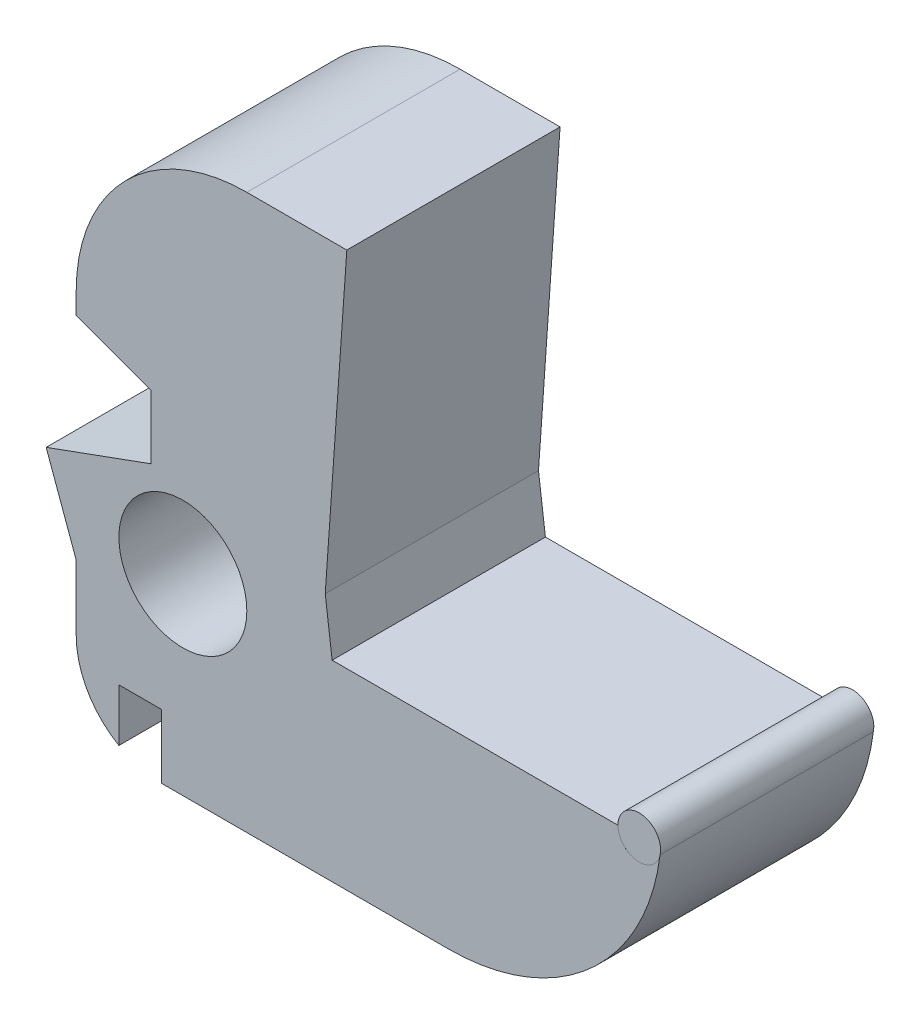
ISO-10303-21;
HEADER;
FILE_DESCRIPTION(('STEP AP214'),'2;1');
FILE_NAME('part.step','',(''),(''),'','','');
FILE_SCHEMA(('AUTOMOTIVE_DESIGN { 1 0 10303 214 1 1 1 1 }'));
ENDSEC;
DATA;
#1=APPLICATION_CONTEXT('core data for automotive mechanical design processes');
#2=APPLICATION_PROTOCOL_DEFINITION('international standard','automotive_design',2000,#1);
#3=PRODUCT_CONTEXT('',#1,'mechanical');
#4=PRODUCT('Part','Part','',(#3));
#5=PRODUCT_RELATED_PRODUCT_CATEGORY('part','',(#4));
#6=PRODUCT_DEFINITION_FORMATION('','',#4);
#7=PRODUCT_DEFINITION_CONTEXT('part definition',#1,'design');
#8=PRODUCT_DEFINITION('design','',#6,#7);
#9=PRODUCT_DEFINITION_SHAPE('','',#8);
#10=(LENGTH_UNIT() NAMED_UNIT(*) SI_UNIT(.MILLI.,.METRE.));
#11=(NAMED_UNIT(*) PLANE_ANGLE_UNIT() SI_UNIT($,.RADIAN.));
#12=(NAMED_UNIT(*) SI_UNIT($,.STERADIAN.) SOLID_ANGLE_UNIT());
#13=UNCERTAINTY_MEASURE_WITH_UNIT(LENGTH_MEASURE(1.E-05),#10,'distance_accuracy_value','');
#14=(GEOMETRIC_REPRESENTATION_CONTEXT(3) GLOBAL_UNCERTAINTY_ASSIGNED_CONTEXT((#13)) GLOBAL_UNIT_ASSIGNED_CONTEXT((#10,
#11,#12)) REPRESENTATION_CONTEXT('',''));
#15=CARTESIAN_POINT('',(0.,0.,0.));
#16=DIRECTION('',(0.,0.,1.));
#17=DIRECTION('',(1.,0.,0.));
#18=AXIS2_PLACEMENT_3D('',#15,#16,#17);
#19=CARTESIAN_POINT('',(0.,0.,10.));
#20=DIRECTION('',(0.,0.,-1.));
#21=DIRECTION('',(-1.,0.,0.));
#22=AXIS2_PLACEMENT_3D('',#19,#20,#21);
#23=PLANE('',#22);
#24=CARTESIAN_POINT('',(-7.,0.,10.));
#25=DIRECTION('',(0.,0.,1.));
#26=DIRECTION('',(1.,0.,0.));
#27=AXIS2_PLACEMENT_3D('',#24,#25,#26);
#28=CIRCLE('',#27,3.);
#29=CARTESIAN_POINT('',(-4.,0.,10.));
#30=VERTEX_POINT('',#29);
#31=EDGE_CURVE('E221',#30,#30,#28,.T.);
#32=ORIENTED_EDGE('',*,*,#31,.F.);
#33=EDGE_LOOP('',(#32));
#34=FACE_BOUND('',#33,.T.);
#35=DIRECTION('',(0.126738131097949,-0.991936210714076,0.));
#36=VECTOR('',#35,1.);
#37=CARTESIAN_POINT('',(0.,0.,10.));
#38=LINE('',#37,#36);
#39=CARTESIAN_POINT('',(-0.323934015290736,2.53532127123254,10.));
#40=VERTEX_POINT('',#39);
#41=CARTESIAN_POINT('',(0.,0.,9.99999999999999));
#42=VERTEX_POINT('',#41);
#43=EDGE_CURVE('E162',#40,#42,#38,.T.);
#44=ORIENTED_EDGE('',*,*,#43,.F.);
#45=DIRECTION('',(0.0697564737441214,0.997564050259825,0.));
#46=VECTOR('',#45,1.);
#47=CARTESIAN_POINT('',(-0.498782025129912,0.0348782368720607,10.));
#48=LINE('',#47,#46);
#49=CARTESIAN_POINT('',(0.687534853999025,17.,10.));
#50=VERTEX_POINT('',#49);
#51=EDGE_CURVE('E173',#40,#50,#48,.T.);
#52=ORIENTED_EDGE('',*,*,#51,.T.);
#53=DIRECTION('',(-1.,0.,0.));
#54=VECTOR('',#53,1.);
#55=CARTESIAN_POINT('',(-12.,17.,10.));
#56=LINE('',#55,#54);
#57=CARTESIAN_POINT('',(-4.,17.,10.));
#58=VERTEX_POINT('',#57);
#59=EDGE_CURVE('E393',#50,#58,#56,.T.);
#60=ORIENTED_EDGE('',*,*,#59,.T.);
#61=CARTESIAN_POINT('',(-3.99999999999999,9.,10.));
#62=DIRECTION('',(0.,0.,-1.));
#63=DIRECTION('',(-1.,0.,0.));
#64=AXIS2_PLACEMENT_3D('',#61,#62,#63);
#65=CIRCLE('',#64,8.);
#66=CARTESIAN_POINT('',(-12.,8.99999999999999,10.));
#67=VERTEX_POINT('',#66);
#68=EDGE_CURVE('E288',#58,#67,#65,.F.);
#69=ORIENTED_EDGE('',*,*,#68,.T.);
#70=DIRECTION('',(0.,-1.,0.));
#71=VECTOR('',#70,1.);
#72=CARTESIAN_POINT('',(-12.,-9.,10.));
#73=LINE('',#72,#71);
#74=CARTESIAN_POINT('',(-12.,7.99999999999999,10.));
#75=VERTEX_POINT('',#74);
#76=EDGE_CURVE('E357',#67,#75,#73,.T.);
#77=ORIENTED_EDGE('',*,*,#76,.T.);
#78=DIRECTION('',(0.93969262078591,-0.342020143325666,0.));
#79=VECTOR('',#78,1.);
#80=CARTESIAN_POINT('',(1.16741709746003,3.20745211435672,10.));
#81=LINE('',#80,#79);
#82=CARTESIAN_POINT('',(-8.5,6.7261041800683,10.));
#83=VERTEX_POINT('',#82);
#84=EDGE_CURVE('E197',#75,#83,#81,.T.);
#85=ORIENTED_EDGE('',*,*,#84,.T.);
#86=DIRECTION('',(0.,-1.,0.));
#87=VECTOR('',#86,1.);
#88=CARTESIAN_POINT('',(-8.5,0.,10.));
#89=LINE('',#88,#87);
#90=CARTESIAN_POINT('',(-8.5,3.7261041800683,10.));
#91=VERTEX_POINT('',#90);
#92=EDGE_CURVE('E200',#83,#91,#89,.T.);
#93=ORIENTED_EDGE('',*,*,#92,.T.);
#94=DIRECTION('',(-0.939692620785907,-0.342020143325673,0.));
#95=VECTOR('',#94,1.);
#96=CARTESIAN_POINT('',(-2.19185791641895,6.02208013201382,10.));
#97=LINE('',#96,#95);
#98=CARTESIAN_POINT('',(-13.4095389311789,1.93917814514806,10.));
#99=VERTEX_POINT('',#98);
#100=EDGE_CURVE('E193',#91,#99,#97,.T.);
#101=ORIENTED_EDGE('',*,*,#100,.T.);
#102=DIRECTION('',(0.342020143325677,-0.939692620785905,0.));
#103=VECTOR('',#102,1.);
#104=CARTESIAN_POINT('',(-13.4095389311789,1.93917814514806,10.));
#105=LINE('',#104,#103);
#106=CARTESIAN_POINT('',(-12.,-1.93349824010795,10.));
#107=VERTEX_POINT('',#106);
#108=EDGE_CURVE('E179',#99,#107,#105,.T.);
#109=ORIENTED_EDGE('',*,*,#108,.T.);
#110=CARTESIAN_POINT('',(-12.,-5.,10.));
#111=VERTEX_POINT('',#110);
#112=EDGE_CURVE('E54',#107,#111,#73,.T.);
#113=ORIENTED_EDGE('',*,*,#112,.T.);
#114=CARTESIAN_POINT('',(-8.,-5.,10.));
#115=DIRECTION('',(0.,0.,-1.));
#116=DIRECTION('',(-1.,0.,0.));
#117=AXIS2_PLACEMENT_3D('',#114,#115,#116);
#118=CIRCLE('',#117,4.);
#119=CARTESIAN_POINT('',(-10.,-8.46410161513776,10.));
#120=VERTEX_POINT('',#119);
#121=EDGE_CURVE('E300',#111,#120,#118,.F.);
#122=ORIENTED_EDGE('',*,*,#121,.T.);
#123=DIRECTION('',(0.,-1.,0.));
#124=VECTOR('',#123,1.);
#125=CARTESIAN_POINT('',(-10.,0.,10.));
#126=LINE('',#125,#124);
#127=CARTESIAN_POINT('',(-10.,-6.,10.));
#128=VERTEX_POINT('',#127);
#129=EDGE_CURVE('E212',#128,#120,#126,.T.);
#130=ORIENTED_EDGE('',*,*,#129,.F.);
#131=DIRECTION('',(-1.,0.,0.));
#132=VECTOR('',#131,1.);
#133=CARTESIAN_POINT('',(0.,-6.,10.));
#134=LINE('',#133,#132);
#135=CARTESIAN_POINT('',(-8.,-6.,10.));
#136=VERTEX_POINT('',#135);
#137=EDGE_CURVE('E219',#136,#128,#134,.T.);
#138=ORIENTED_EDGE('',*,*,#137,.F.);
#139=DIRECTION('',(0.,1.,0.));
#140=VECTOR('',#139,1.);
#141=CARTESIAN_POINT('',(-8.,0.,10.));
#142=LINE('',#141,#140);
#143=CARTESIAN_POINT('',(-8.,-9.,10.));
#144=VERTEX_POINT('',#143);
#145=EDGE_CURVE('E217',#144,#136,#142,.T.);
#146=ORIENTED_EDGE('',*,*,#145,.F.);
#147=DIRECTION('',(1.,0.,0.));
#148=VECTOR('',#147,1.);
#149=CARTESIAN_POINT('',(15.4,-9.,10.));
#150=LINE('',#149,#148);
#151=CARTESIAN_POINT('',(5.4501256289338,-9.,10.));
#152=VERTEX_POINT('',#151);
#153=EDGE_CURVE('E248',#144,#152,#150,.T.);
#154=ORIENTED_EDGE('',*,*,#153,.T.);
#155=CARTESIAN_POINT('',(5.4501256289338,1.,10.));
#156=DIRECTION('',(0.,0.,-1.));
#157=DIRECTION('',(-1.,0.,0.));
#158=AXIS2_PLACEMENT_3D('',#155,#156,#157);
#159=CIRCLE('',#158,10.);
#160=CARTESIAN_POINT('',(15.3753391639486,-0.220711384545762,10.));
#161=VERTEX_POINT('',#160);
#162=EDGE_CURVE('E367',#152,#161,#159,.F.);
#163=ORIENTED_EDGE('',*,*,#162,.T.);
#164=CARTESIAN_POINT('',(14.4,0.,10.));
#165=DIRECTION('',(0.,0.,-1.));
#166=DIRECTION('',(-1.,0.,0.));
#167=AXIS2_PLACEMENT_3D('',#164,#165,#166);
#168=CIRCLE('',#167,1.);
#169=CARTESIAN_POINT('',(13.4,0.,10.));
#170=VERTEX_POINT('',#169);
#171=EDGE_CURVE('E237',#161,#170,#168,.T.);
#172=ORIENTED_EDGE('',*,*,#171,.T.);
#173=DIRECTION('',(-1.,0.,0.));
#174=VECTOR('',#173,1.);
#175=CARTESIAN_POINT('',(0.,0.,10.));
#176=LINE('',#175,#174);
#177=EDGE_CURVE('E177',#170,#42,#176,.T.);
#178=ORIENTED_EDGE('',*,*,#177,.T.);
#179=EDGE_LOOP('',(#44,#52,#60,#69,#77,#85,#93,#101,#109,#113,#122,#130,#138,#146,#154,#163,
#172,#178));
#180=FACE_BOUND('',#179,.T.);
#181=ADVANCED_FACE('F34',(#34,#180),#23,.F.);
#182=CARTESIAN_POINT('',(0.,0.,0.));
#183=DIRECTION('',(0.,0.,-1.));
#184=DIRECTION('',(-1.,0.,0.));
#185=AXIS2_PLACEMENT_3D('',#182,#183,#184);
#186=PLANE('',#185);
#187=CARTESIAN_POINT('',(-7.,0.,0.));
#188=DIRECTION('',(0.,0.,1.));
#189=DIRECTION('',(1.,0.,0.));
#190=AXIS2_PLACEMENT_3D('',#187,#188,#189);
#191=CIRCLE('',#190,3.);
#192=CARTESIAN_POINT('',(-4.,0.,0.));
#193=VERTEX_POINT('',#192);
#194=EDGE_CURVE('E222',#193,#193,#191,.T.);
#195=ORIENTED_EDGE('',*,*,#194,.T.);
#196=EDGE_LOOP('',(#195));
#197=FACE_BOUND('',#196,.T.);
#198=DIRECTION('',(0.0697564737441214,0.997564050259825,0.));
#199=VECTOR('',#198,1.);
#200=CARTESIAN_POINT('',(-0.498782025129912,0.0348782368720607,0.));
#201=LINE('',#200,#199);
#202=CARTESIAN_POINT('',(-0.323934015290736,2.53532127123254,0.));
#203=VERTEX_POINT('',#202);
#204=CARTESIAN_POINT('',(0.687534853999021,17.,0.));
#205=VERTEX_POINT('',#204);
#206=EDGE_CURVE('E169',#203,#205,#201,.T.);
#207=ORIENTED_EDGE('',*,*,#206,.F.);
#208=DIRECTION('',(0.126738131097949,-0.991936210714076,0.));
#209=VECTOR('',#208,1.);
#210=CARTESIAN_POINT('',(0.,0.,0.));
#211=LINE('',#210,#209);
#212=CARTESIAN_POINT('',(0.,0.,0.));
#213=VERTEX_POINT('',#212);
#214=EDGE_CURVE('E165',#203,#213,#211,.T.);
#215=ORIENTED_EDGE('',*,*,#214,.T.);
#216=DIRECTION('',(-1.,0.,0.));
#217=VECTOR('',#216,1.);
#218=CARTESIAN_POINT('',(0.,0.,0.));
#219=LINE('',#218,#217);
#220=CARTESIAN_POINT('',(13.4,0.,0.));
#221=VERTEX_POINT('',#220);
#222=EDGE_CURVE('E387',#221,#213,#219,.T.);
#223=ORIENTED_EDGE('',*,*,#222,.F.);
#224=CARTESIAN_POINT('',(14.4,0.,0.));
#225=DIRECTION('',(0.,0.,1.));
#226=DIRECTION('',(1.,0.,0.));
#227=AXIS2_PLACEMENT_3D('',#224,#225,#226);
#228=CIRCLE('',#227,1.);
#229=CARTESIAN_POINT('',(15.4,0.,0.));
#230=VERTEX_POINT('',#229);
#231=EDGE_CURVE('E230',#230,#221,#228,.T.);
#232=ORIENTED_EDGE('',*,*,#231,.F.);
#233=CARTESIAN_POINT('',(15.4,0.,0.));
#234=DIRECTION('',(-0.111042415435344,-0.993815668006036,0.));
#235=VECTOR('',#234,1.);
#236=LINE('',#233,#235);
#237=CARTESIAN_POINT('',(15.3753391639486,-0.220711384545757,0.));
#238=VERTEX_POINT('',#237);
#239=EDGE_CURVE('E242',#230,#238,#236,.T.);
#240=ORIENTED_EDGE('',*,*,#239,.T.);
#241=CARTESIAN_POINT('',(5.4501256289338,1.,0.));
#242=DIRECTION('',(0.,0.,-1.));
#243=DIRECTION('',(-1.,0.,0.));
#244=AXIS2_PLACEMENT_3D('',#241,#242,#243);
#245=CIRCLE('',#244,10.);
#246=CARTESIAN_POINT('',(5.4501256289338,-9.,0.));
#247=VERTEX_POINT('',#246);
#248=EDGE_CURVE('E280',#238,#247,#245,.T.);
#249=ORIENTED_EDGE('',*,*,#248,.T.);
#250=DIRECTION('',(1.,0.,0.));
#251=VECTOR('',#250,1.);
#252=CARTESIAN_POINT('',(15.4,-9.,0.));
#253=LINE('',#252,#251);
#254=CARTESIAN_POINT('',(-8.,-9.,0.));
#255=VERTEX_POINT('',#254);
#256=EDGE_CURVE('E383',#255,#247,#253,.T.);
#257=ORIENTED_EDGE('',*,*,#256,.F.);
#258=DIRECTION('',(0.,1.,0.));
#259=VECTOR('',#258,1.);
#260=CARTESIAN_POINT('',(-8.,0.,0.));
#261=LINE('',#260,#259);
#262=CARTESIAN_POINT('',(-8.,-6.,0.));
#263=VERTEX_POINT('',#262);
#264=EDGE_CURVE('E214',#255,#263,#261,.T.);
#265=ORIENTED_EDGE('',*,*,#264,.T.);
#266=DIRECTION('',(-1.,0.,0.));
#267=VECTOR('',#266,1.);
#268=CARTESIAN_POINT('',(0.,-6.,0.));
#269=LINE('',#268,#267);
#270=CARTESIAN_POINT('',(-10.,-6.,0.));
#271=VERTEX_POINT('',#270);
#272=EDGE_CURVE('E306',#263,#271,#269,.T.);
#273=ORIENTED_EDGE('',*,*,#272,.T.);
#274=DIRECTION('',(0.,-1.,0.));
#275=VECTOR('',#274,1.);
#276=CARTESIAN_POINT('',(-10.,0.,0.));
#277=LINE('',#276,#275);
#278=CARTESIAN_POINT('',(-10.,-8.46410161513776,0.));
#279=VERTEX_POINT('',#278);
#280=EDGE_CURVE('E209',#271,#279,#277,.T.);
#281=ORIENTED_EDGE('',*,*,#280,.T.);
#282=CARTESIAN_POINT('',(-8.,-5.,0.));
#283=DIRECTION('',(0.,0.,-1.));
#284=DIRECTION('',(-1.,0.,0.));
#285=AXIS2_PLACEMENT_3D('',#282,#283,#284);
#286=CIRCLE('',#285,4.);
#287=CARTESIAN_POINT('',(-12.,-5.,0.));
#288=VERTEX_POINT('',#287);
#289=EDGE_CURVE('E294',#279,#288,#286,.T.);
#290=ORIENTED_EDGE('',*,*,#289,.T.);
#291=DIRECTION('',(0.,-1.,0.));
#292=VECTOR('',#291,1.);
#293=CARTESIAN_POINT('',(-12.,-9.,0.));
#294=LINE('',#293,#292);
#295=CARTESIAN_POINT('',(-12.,-1.93349824010795,0.));
#296=VERTEX_POINT('',#295);
#297=EDGE_CURVE('E326',#296,#288,#294,.T.);
#298=ORIENTED_EDGE('',*,*,#297,.F.);
#299=DIRECTION('',(0.342020143325677,-0.939692620785905,0.));
#300=VECTOR('',#299,1.);
#301=CARTESIAN_POINT('',(-13.4095389311789,1.93917814514806,0.));
#302=LINE('',#301,#300);
#303=CARTESIAN_POINT('',(-13.4095389311789,1.93917814514806,0.));
#304=VERTEX_POINT('',#303);
#305=EDGE_CURVE('E325',#304,#296,#302,.T.);
#306=ORIENTED_EDGE('',*,*,#305,.F.);
#307=DIRECTION('',(-0.939692620785907,-0.342020143325673,0.));
#308=VECTOR('',#307,1.);
#309=CARTESIAN_POINT('',(-2.19185791641895,6.02208013201382,0.));
#310=LINE('',#309,#308);
#311=CARTESIAN_POINT('',(-8.5,3.7261041800683,0.));
#312=VERTEX_POINT('',#311);
#313=EDGE_CURVE('E191',#312,#304,#310,.T.);
#314=ORIENTED_EDGE('',*,*,#313,.F.);
#315=DIRECTION('',(0.,-1.,0.));
#316=VECTOR('',#315,1.);
#317=CARTESIAN_POINT('',(-8.5,0.,0.));
#318=LINE('',#317,#316);
#319=CARTESIAN_POINT('',(-8.5,6.7261041800683,0.));
#320=VERTEX_POINT('',#319);
#321=EDGE_CURVE('E42',#320,#312,#318,.T.);
#322=ORIENTED_EDGE('',*,*,#321,.F.);
#323=DIRECTION('',(0.93969262078591,-0.342020143325666,0.));
#324=VECTOR('',#323,1.);
#325=CARTESIAN_POINT('',(1.16741709746003,3.20745211435672,0.));
#326=LINE('',#325,#324);
#327=CARTESIAN_POINT('',(-12.,7.99999999999999,0.));
#328=VERTEX_POINT('',#327);
#329=EDGE_CURVE('E195',#328,#320,#326,.T.);
#330=ORIENTED_EDGE('',*,*,#329,.F.);
#331=CARTESIAN_POINT('',(-12.,8.99999999999999,0.));
#332=VERTEX_POINT('',#331);
#333=EDGE_CURVE('E343',#332,#328,#294,.T.);
#334=ORIENTED_EDGE('',*,*,#333,.F.);
#335=CARTESIAN_POINT('',(-3.99999999999999,9.,0.));
#336=DIRECTION('',(0.,0.,-1.));
#337=DIRECTION('',(-1.,0.,0.));
#338=AXIS2_PLACEMENT_3D('',#335,#336,#337);
#339=CIRCLE('',#338,8.);
#340=CARTESIAN_POINT('',(-4.,17.,0.));
#341=VERTEX_POINT('',#340);
#342=EDGE_CURVE('E361',#332,#341,#339,.T.);
#343=ORIENTED_EDGE('',*,*,#342,.T.);
#344=DIRECTION('',(-1.,0.,0.));
#345=VECTOR('',#344,1.);
#346=CARTESIAN_POINT('',(-12.,17.,0.));
#347=LINE('',#346,#345);
#348=EDGE_CURVE('E350',#205,#341,#347,.T.);
#349=ORIENTED_EDGE('',*,*,#348,.F.);
#350=EDGE_LOOP('',(#207,#215,#223,#232,#240,#249,#257,#265,#273,#281,#290,#298,#306,#314,#322,
#330,#334,#343,#349));
#351=FACE_BOUND('',#350,.T.);
#352=ADVANCED_FACE('F265',(#197,#351),#186,.T.);
#353=CARTESIAN_POINT('',(-12.,-9.,10.));
#354=DIRECTION('',(1.,0.,0.));
#355=DIRECTION('',(0.,1.,0.));
#356=AXIS2_PLACEMENT_3D('',#353,#354,#355);
#357=PLANE('',#356);
#358=ORIENTED_EDGE('',*,*,#333,.T.);
#359=DIRECTION('',(0.,0.,1.));
#360=VECTOR('',#359,1.);
#361=CARTESIAN_POINT('',(-12.,7.99999999999999,10.));
#362=LINE('',#361,#360);
#363=EDGE_CURVE('E309',#328,#75,#362,.T.);
#364=ORIENTED_EDGE('',*,*,#363,.T.);
#365=ORIENTED_EDGE('',*,*,#76,.F.);
#366=DIRECTION('',(0.,0.,1.));
#367=VECTOR('',#366,1.);
#368=CARTESIAN_POINT('',(-12.,8.99999999999999,10.));
#369=LINE('',#368,#367);
#370=EDGE_CURVE('E348',#67,#332,#369,.F.);
#371=ORIENTED_EDGE('',*,*,#370,.T.);
#372=EDGE_LOOP('',(#358,#364,#365,#371));
#373=FACE_BOUND('',#372,.T.);
#374=ADVANCED_FACE('F270',(#373),#357,.F.);
#375=CARTESIAN_POINT('',(-8.,-5.,10.));
#376=DIRECTION('',(0.,0.,-1.));
#377=DIRECTION('',(-1.,0.,0.));
#378=AXIS2_PLACEMENT_3D('',#375,#376,#377);
#379=CYLINDRICAL_SURFACE('',#378,4.);
#380=ORIENTED_EDGE('',*,*,#289,.F.);
#381=DIRECTION('',(0.,0.,-1.));
#382=VECTOR('',#381,1.);
#383=CARTESIAN_POINT('',(-10.,-8.46410161513776,10.));
#384=LINE('',#383,#382);
#385=EDGE_CURVE('E303',#279,#120,#384,.F.);
#386=ORIENTED_EDGE('',*,*,#385,.T.);
#387=ORIENTED_EDGE('',*,*,#121,.F.);
#388=DIRECTION('',(0.,0.,-1.));
#389=VECTOR('',#388,1.);
#390=CARTESIAN_POINT('',(-12.,-5.,10.));
#391=LINE('',#390,#389);
#392=EDGE_CURVE('E298',#288,#111,#391,.F.);
#393=ORIENTED_EDGE('',*,*,#392,.F.);
#394=EDGE_LOOP('',(#380,#386,#387,#393));
#395=FACE_BOUND('',#394,.T.);
#396=ADVANCED_FACE('F36',(#395),#379,.T.);
#397=CARTESIAN_POINT('',(-3.99999999999999,9.,10.));
#398=DIRECTION('',(0.,0.,1.));
#399=DIRECTION('',(1.,0.,0.));
#400=AXIS2_PLACEMENT_3D('',#397,#398,#399);
#401=CYLINDRICAL_SURFACE('',#400,8.);
#402=DIRECTION('',(0.,0.,1.));
#403=VECTOR('',#402,1.);
#404=CARTESIAN_POINT('',(-3.99999999999999,17.,10.));
#405=LINE('',#404,#403);
#406=EDGE_CURVE('E356',#341,#58,#405,.T.);
#407=ORIENTED_EDGE('',*,*,#406,.F.);
#408=ORIENTED_EDGE('',*,*,#342,.F.);
#409=ORIENTED_EDGE('',*,*,#370,.F.);
#410=ORIENTED_EDGE('',*,*,#68,.F.);
#411=EDGE_LOOP('',(#407,#408,#409,#410));
#412=FACE_BOUND('',#411,.T.);
#413=ADVANCED_FACE('F398',(#412),#401,.T.);
#414=CARTESIAN_POINT('',(15.4,-9.,10.));
#415=DIRECTION('',(0.,1.,0.));
#416=DIRECTION('',(-1.,0.,0.));
#417=AXIS2_PLACEMENT_3D('',#414,#415,#416);
#418=PLANE('',#417);
#419=ORIENTED_EDGE('',*,*,#153,.F.);
#420=DIRECTION('',(0.,0.,-1.));
#421=VECTOR('',#420,1.);
#422=CARTESIAN_POINT('',(-8.,-9.,10.));
#423=LINE('',#422,#421);
#424=EDGE_CURVE('E291',#144,#255,#423,.T.);
#425=ORIENTED_EDGE('',*,*,#424,.T.);
#426=ORIENTED_EDGE('',*,*,#256,.T.);
#427=DIRECTION('',(0.,0.,1.));
#428=VECTOR('',#427,1.);
#429=CARTESIAN_POINT('',(5.4501256289338,-9.,10.));
#430=LINE('',#429,#428);
#431=EDGE_CURVE('E364',#247,#152,#430,.T.);
#432=ORIENTED_EDGE('',*,*,#431,.T.);
#433=EDGE_LOOP('',(#419,#425,#426,#432));
#434=FACE_BOUND('',#433,.T.);
#435=ADVANCED_FACE('F403',(#434),#418,.F.);
#436=CARTESIAN_POINT('',(0.,0.,10.));
#437=DIRECTION('',(0.,-1.,0.));
#438=DIRECTION('',(0.,0.,-1.));
#439=AXIS2_PLACEMENT_3D('',#436,#437,#438);
#440=PLANE('',#439);
#441=ORIENTED_EDGE('',*,*,#177,.F.);
#442=DIRECTION('',(0.,0.,1.));
#443=VECTOR('',#442,1.);
#444=CARTESIAN_POINT('',(13.4,0.,0.));
#445=LINE('',#444,#443);
#446=EDGE_CURVE('E233',#170,#221,#445,.F.);
#447=ORIENTED_EDGE('',*,*,#446,.T.);
#448=ORIENTED_EDGE('',*,*,#222,.T.);
#449=DIRECTION('',(0.,0.,-1.));
#450=VECTOR('',#449,1.);
#451=CARTESIAN_POINT('',(0.,0.,10.));
#452=LINE('',#451,#450);
#453=EDGE_CURVE('E354',#42,#213,#452,.T.);
#454=ORIENTED_EDGE('',*,*,#453,.F.);
#455=EDGE_LOOP('',(#441,#447,#448,#454));
#456=FACE_BOUND('',#455,.T.);
#457=ADVANCED_FACE('F401',(#456),#440,.F.);
#458=CARTESIAN_POINT('',(-12.,17.,10.));
#459=DIRECTION('',(0.,-1.,0.));
#460=DIRECTION('',(1.,0.,0.));
#461=AXIS2_PLACEMENT_3D('',#458,#459,#460);
#462=PLANE('',#461);
#463=ORIENTED_EDGE('',*,*,#59,.F.);
#464=DIRECTION('',(0.,0.,-1.));
#465=VECTOR('',#464,1.);
#466=CARTESIAN_POINT('',(0.687534853999024,17.,10.));
#467=LINE('',#466,#465);
#468=EDGE_CURVE('E11',#50,#205,#467,.T.);
#469=ORIENTED_EDGE('',*,*,#468,.T.);
#470=ORIENTED_EDGE('',*,*,#348,.T.);
#471=ORIENTED_EDGE('',*,*,#406,.T.);
#472=EDGE_LOOP('',(#463,#469,#470,#471));
#473=FACE_BOUND('',#472,.T.);
#474=ADVANCED_FACE('F399',(#473),#462,.F.);
#475=ORIENTED_EDGE('',*,*,#112,.F.);
#476=DIRECTION('',(0.,0.,1.));
#477=VECTOR('',#476,1.);
#478=CARTESIAN_POINT('',(-12.,-1.93349824010795,0.));
#479=LINE('',#478,#477);
#480=EDGE_CURVE('E49',#296,#107,#479,.T.);
#481=ORIENTED_EDGE('',*,*,#480,.F.);
#482=ORIENTED_EDGE('',*,*,#297,.T.);
#483=ORIENTED_EDGE('',*,*,#392,.T.);
#484=EDGE_LOOP('',(#475,#481,#482,#483));
#485=FACE_BOUND('',#484,.T.);
#486=ADVANCED_FACE('F272',(#485),#357,.F.);
#487=CARTESIAN_POINT('',(5.4501256289338,1.,10.));
#488=DIRECTION('',(0.,0.,1.));
#489=DIRECTION('',(1.,0.,0.));
#490=AXIS2_PLACEMENT_3D('',#487,#488,#489);
#491=CYLINDRICAL_SURFACE('',#490,10.);
#492=DIRECTION('',(0.,0.,1.));
#493=VECTOR('',#492,1.);
#494=CARTESIAN_POINT('',(15.3753391639486,-0.220711384545762,5.00005));
#495=LINE('',#494,#493);
#496=EDGE_CURVE('E295',#161,#238,#495,.F.);
#497=ORIENTED_EDGE('',*,*,#496,.F.);
#498=ORIENTED_EDGE('',*,*,#162,.F.);
#499=ORIENTED_EDGE('',*,*,#431,.F.);
#500=ORIENTED_EDGE('',*,*,#248,.F.);
#501=EDGE_LOOP('',(#497,#498,#499,#500));
#502=FACE_BOUND('',#501,.T.);
#503=ADVANCED_FACE('F261',(#502),#491,.T.);
#504=CARTESIAN_POINT('',(14.4,0.,0.));
#505=DIRECTION('',(0.,0.,1.));
#506=DIRECTION('',(1.,0.,0.));
#507=AXIS2_PLACEMENT_3D('',#504,#505,#506);
#508=CYLINDRICAL_SURFACE('',#507,1.);
#509=ORIENTED_EDGE('',*,*,#171,.F.);
#510=ORIENTED_EDGE('',*,*,#496,.T.);
#511=ORIENTED_EDGE('',*,*,#239,.F.);
#512=ORIENTED_EDGE('',*,*,#231,.T.);
#513=ORIENTED_EDGE('',*,*,#446,.F.);
#514=EDGE_LOOP('',(#509,#510,#511,#512,#513));
#515=FACE_BOUND('',#514,.T.);
#516=CARTESIAN_POINT('',(14.4,0.,10.0001));
#517=DIRECTION('',(0.,0.,1.));
#518=DIRECTION('',(1.,0.,0.));
#519=AXIS2_PLACEMENT_3D('',#516,#517,#518);
#520=CIRCLE('',#519,1.);
#521=CARTESIAN_POINT('',(15.4,0.,10.0001));
#522=VERTEX_POINT('',#521);
#523=EDGE_CURVE('E225',#522,#522,#520,.T.);
#524=ORIENTED_EDGE('',*,*,#523,.F.);
#525=EDGE_LOOP('',(#524));
#526=FACE_BOUND('',#525,.T.);
#527=ADVANCED_FACE('F250',(#515,#526),#508,.T.);
#528=CARTESIAN_POINT('',(14.4,0.,10.0001));
#529=DIRECTION('',(0.,0.,1.));
#530=DIRECTION('',(1.,0.,0.));
#531=AXIS2_PLACEMENT_3D('',#528,#529,#530);
#532=PLANE('',#531);
#533=ORIENTED_EDGE('',*,*,#523,.T.);
#534=EDGE_LOOP('',(#533));
#535=FACE_BOUND('',#534,.T.);
#536=ADVANCED_FACE('F260',(#535),#532,.T.);
#537=CARTESIAN_POINT('',(-7.,0.,0.));
#538=DIRECTION('',(0.,0.,1.));
#539=DIRECTION('',(1.,0.,0.));
#540=AXIS2_PLACEMENT_3D('',#537,#538,#539);
#541=CYLINDRICAL_SURFACE('',#540,3.);
#542=ORIENTED_EDGE('',*,*,#194,.F.);
#543=EDGE_LOOP('',(#542));
#544=FACE_BOUND('',#543,.T.);
#545=ORIENTED_EDGE('',*,*,#31,.T.);
#546=EDGE_LOOP('',(#545));
#547=FACE_BOUND('',#546,.T.);
#548=ADVANCED_FACE('F445',(#544,#547),#541,.F.);
#549=CARTESIAN_POINT('',(-10.,-6.,71.407803300846));
#550=DIRECTION('',(0.,-1.,0.));
#551=DIRECTION('',(0.,0.,-1.));
#552=AXIS2_PLACEMENT_3D('',#549,#550,#551);
#553=PLANE('',#552);
#554=DIRECTION('',(0.,0.,-1.));
#555=VECTOR('',#554,1.);
#556=CARTESIAN_POINT('',(-8.,-6.,71.407803300846));
#557=LINE('',#556,#555);
#558=EDGE_CURVE('E206',#136,#263,#557,.T.);
#559=ORIENTED_EDGE('',*,*,#558,.F.);
#560=ORIENTED_EDGE('',*,*,#137,.T.);
#561=DIRECTION('',(0.,0.,-1.));
#562=VECTOR('',#561,1.);
#563=CARTESIAN_POINT('',(-10.,-6.,71.407803300846));
#564=LINE('',#563,#562);
#565=EDGE_CURVE('E203',#128,#271,#564,.T.);
#566=ORIENTED_EDGE('',*,*,#565,.T.);
#567=ORIENTED_EDGE('',*,*,#272,.F.);
#568=EDGE_LOOP('',(#559,#560,#566,#567));
#569=FACE_BOUND('',#568,.T.);
#570=ADVANCED_FACE('F434',(#569),#553,.T.);
#571=CARTESIAN_POINT('',(-8.,-9.,71.407803300846));
#572=DIRECTION('',(-1.,0.,0.));
#573=DIRECTION('',(0.,0.,1.));
#574=AXIS2_PLACEMENT_3D('',#571,#572,#573);
#575=PLANE('',#574);
#576=ORIENTED_EDGE('',*,*,#424,.F.);
#577=ORIENTED_EDGE('',*,*,#145,.T.);
#578=ORIENTED_EDGE('',*,*,#558,.T.);
#579=ORIENTED_EDGE('',*,*,#264,.F.);
#580=EDGE_LOOP('',(#576,#577,#578,#579));
#581=FACE_BOUND('',#580,.T.);
#582=ADVANCED_FACE('F437',(#581),#575,.T.);
#583=CARTESIAN_POINT('',(-10.,-6.,71.407803300846));
#584=DIRECTION('',(1.,0.,0.));
#585=DIRECTION('',(0.,1.,0.));
#586=AXIS2_PLACEMENT_3D('',#583,#584,#585);
#587=PLANE('',#586);
#588=ORIENTED_EDGE('',*,*,#565,.F.);
#589=ORIENTED_EDGE('',*,*,#129,.T.);
#590=ORIENTED_EDGE('',*,*,#385,.F.);
#591=ORIENTED_EDGE('',*,*,#280,.F.);
#592=EDGE_LOOP('',(#588,#589,#590,#591));
#593=FACE_BOUND('',#592,.T.);
#594=ADVANCED_FACE('F430',(#593),#587,.T.);
#595=CARTESIAN_POINT('',(-8.5,3.7261041800683,58.907803300846));
#596=DIRECTION('',(1.,0.,0.));
#597=DIRECTION('',(0.,0.,-1.));
#598=AXIS2_PLACEMENT_3D('',#595,#596,#597);
#599=PLANE('',#598);
#600=ORIENTED_EDGE('',*,*,#92,.F.);
#601=DIRECTION('',(0.,0.,-1.));
#602=VECTOR('',#601,1.);
#603=CARTESIAN_POINT('',(-8.5,6.7261041800683,58.907803300846));
#604=LINE('',#603,#602);
#605=EDGE_CURVE('E185',#83,#320,#604,.T.);
#606=ORIENTED_EDGE('',*,*,#605,.T.);
#607=ORIENTED_EDGE('',*,*,#321,.T.);
#608=DIRECTION('',(0.,0.,-1.));
#609=VECTOR('',#608,1.);
#610=CARTESIAN_POINT('',(-8.5,3.7261041800683,58.907803300846));
#611=LINE('',#610,#609);
#612=EDGE_CURVE('E182',#91,#312,#611,.T.);
#613=ORIENTED_EDGE('',*,*,#612,.F.);
#614=EDGE_LOOP('',(#600,#606,#607,#613));
#615=FACE_BOUND('',#614,.T.);
#616=ADVANCED_FACE('F314',(#615),#599,.F.);
#617=CARTESIAN_POINT('',(-8.5,6.7261041800683,58.907803300846));
#618=DIRECTION('',(0.342020143325666,0.93969262078591,0.));
#619=DIRECTION('',(-0.93969262078591,0.342020143325666,0.));
#620=AXIS2_PLACEMENT_3D('',#617,#618,#619);
#621=PLANE('',#620);
#622=ORIENTED_EDGE('',*,*,#84,.F.);
#623=ORIENTED_EDGE('',*,*,#363,.F.);
#624=ORIENTED_EDGE('',*,*,#329,.T.);
#625=ORIENTED_EDGE('',*,*,#605,.F.);
#626=EDGE_LOOP('',(#622,#623,#624,#625));
#627=FACE_BOUND('',#626,.T.);
#628=ADVANCED_FACE('F339',(#627),#621,.F.);
#629=CARTESIAN_POINT('',(-8.5,3.7261041800683,58.907803300846));
#630=DIRECTION('',(0.342020143325673,-0.939692620785907,0.));
#631=DIRECTION('',(0.939692620785907,0.342020143325673,0.));
#632=AXIS2_PLACEMENT_3D('',#629,#630,#631);
#633=PLANE('',#632);
#634=ORIENTED_EDGE('',*,*,#100,.F.);
#635=ORIENTED_EDGE('',*,*,#612,.T.);
#636=ORIENTED_EDGE('',*,*,#313,.T.);
#637=DIRECTION('',(0.,0.,1.));
#638=VECTOR('',#637,1.);
#639=CARTESIAN_POINT('',(-13.4095389311789,1.93917814514806,0.));
#640=LINE('',#639,#638);
#641=EDGE_CURVE('E328',#304,#99,#640,.T.);
#642=ORIENTED_EDGE('',*,*,#641,.T.);
#643=EDGE_LOOP('',(#634,#635,#636,#642));
#644=FACE_BOUND('',#643,.T.);
#645=ADVANCED_FACE('F320',(#644),#633,.F.);
#646=CARTESIAN_POINT('',(-0.323934015290736,2.53532127123254,71.407803300846));
#647=DIRECTION('',(-0.997564050259824,0.0697564737441214,0.));
#648=DIRECTION('',(-0.0697564737441214,-0.997564050259825,0.));
#649=AXIS2_PLACEMENT_3D('',#646,#647,#648);
#650=PLANE('',#649);
#651=ORIENTED_EDGE('',*,*,#51,.F.);
#652=DIRECTION('',(0.,0.,-1.));
#653=VECTOR('',#652,1.);
#654=CARTESIAN_POINT('',(-0.323934015290736,2.53532127123254,71.407803300846));
#655=LINE('',#654,#653);
#656=EDGE_CURVE('E159',#40,#203,#655,.T.);
#657=ORIENTED_EDGE('',*,*,#656,.T.);
#658=ORIENTED_EDGE('',*,*,#206,.T.);
#659=ORIENTED_EDGE('',*,*,#468,.F.);
#660=EDGE_LOOP('',(#651,#657,#658,#659));
#661=FACE_BOUND('',#660,.T.);
#662=ADVANCED_FACE('F181',(#661),#650,.F.);
#663=CARTESIAN_POINT('',(-13.4095389311789,1.93917814514806,0.));
#664=DIRECTION('',(-0.939692620785905,-0.342020143325677,0.));
#665=DIRECTION('',(0.342020143325677,-0.939692620785905,0.));
#666=AXIS2_PLACEMENT_3D('',#663,#664,#665);
#667=PLANE('',#666);
#668=ORIENTED_EDGE('',*,*,#108,.F.);
#669=ORIENTED_EDGE('',*,*,#641,.F.);
#670=ORIENTED_EDGE('',*,*,#305,.T.);
#671=ORIENTED_EDGE('',*,*,#480,.T.);
#672=EDGE_LOOP('',(#668,#669,#670,#671));
#673=FACE_BOUND('',#672,.T.);
#674=ADVANCED_FACE('F336',(#673),#667,.T.);
#675=CARTESIAN_POINT('',(-0.323934015290736,2.53532127123254,72.6592605827439));
#676=DIRECTION('',(0.991936210714076,0.126738131097949,0.));
#677=DIRECTION('',(-0.126738131097949,0.991936210714076,0.));
#678=AXIS2_PLACEMENT_3D('',#675,#676,#677);
#679=PLANE('',#678);
#680=ORIENTED_EDGE('',*,*,#656,.F.);
#681=ORIENTED_EDGE('',*,*,#43,.T.);
#682=ORIENTED_EDGE('',*,*,#453,.T.);
#683=ORIENTED_EDGE('',*,*,#214,.F.);
#684=EDGE_LOOP('',(#680,#681,#682,#683));
#685=FACE_BOUND('',#684,.T.);
#686=ADVANCED_FACE('F161',(#685),#679,.T.);
#687=CLOSED_SHELL('',(#181,#352,#374,#396,#413,#435,#457,#474,#486,#503,#527,#536,#548,#570,
#582,#594,#616,#628,#645,#662,#674,#686));
#688=MANIFOLD_SOLID_BREP('B2',#687);
#689=ADVANCED_BREP_SHAPE_REPRESENTATION('',(#18,#688),#14);
#690=SHAPE_DEFINITION_REPRESENTATION(#9,#689);
ENDSEC;
END-ISO-10303-21;
